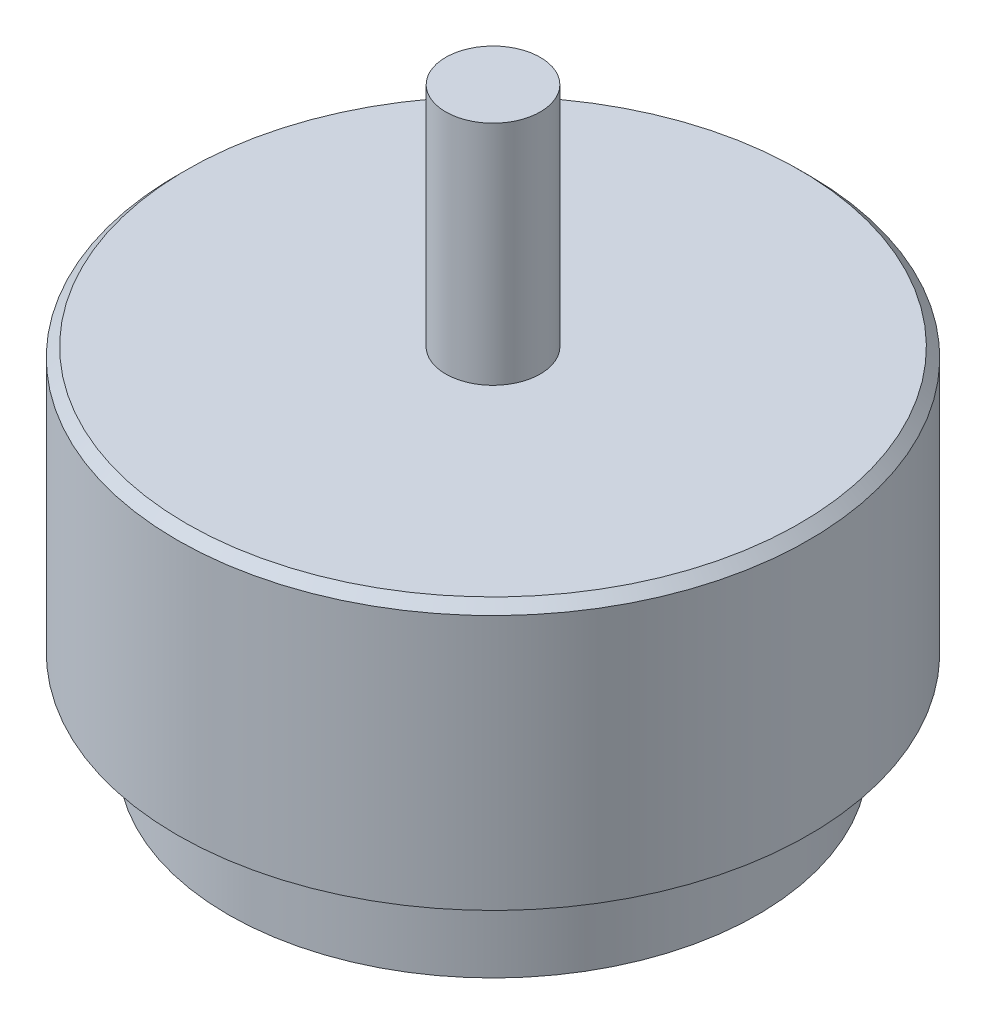
ISO-10303-21;
HEADER;
FILE_DESCRIPTION(('STEP AP214'),'2;1');
FILE_NAME('part.step','',(''),(''),'','','');
FILE_SCHEMA(('AUTOMOTIVE_DESIGN { 1 0 10303 214 1 1 1 1 }'));
ENDSEC;
DATA;
#1=APPLICATION_CONTEXT('core data for automotive mechanical design processes');
#2=APPLICATION_PROTOCOL_DEFINITION('international standard','automotive_design',2000,#1);
#3=PRODUCT_CONTEXT('',#1,'mechanical');
#4=PRODUCT('Part','Part','',(#3));
#5=PRODUCT_RELATED_PRODUCT_CATEGORY('part','',(#4));
#6=PRODUCT_DEFINITION_FORMATION('','',#4);
#7=PRODUCT_DEFINITION_CONTEXT('part definition',#1,'design');
#8=PRODUCT_DEFINITION('design','',#6,#7);
#9=PRODUCT_DEFINITION_SHAPE('','',#8);
#10=(LENGTH_UNIT() NAMED_UNIT(*) SI_UNIT(.MILLI.,.METRE.));
#11=(NAMED_UNIT(*) PLANE_ANGLE_UNIT() SI_UNIT($,.RADIAN.));
#12=(NAMED_UNIT(*) SI_UNIT($,.STERADIAN.) SOLID_ANGLE_UNIT());
#13=UNCERTAINTY_MEASURE_WITH_UNIT(LENGTH_MEASURE(1.E-05),#10,'distance_accuracy_value','');
#14=(GEOMETRIC_REPRESENTATION_CONTEXT(3) GLOBAL_UNCERTAINTY_ASSIGNED_CONTEXT((#13)) GLOBAL_UNIT_ASSIGNED_CONTEXT((#10,
#11,#12)) REPRESENTATION_CONTEXT('',''));
#15=CARTESIAN_POINT('',(0.,0.,0.));
#16=DIRECTION('',(0.,0.,1.));
#17=DIRECTION('',(1.,0.,0.));
#18=AXIS2_PLACEMENT_3D('',#15,#16,#17);
#19=CARTESIAN_POINT('',(0.,5.,0.));
#20=DIRECTION('',(0.,-1.,0.));
#21=DIRECTION('',(0.,0.,-1.));
#22=AXIS2_PLACEMENT_3D('',#19,#20,#21);
#23=CYLINDRICAL_SURFACE('',#22,14.);
#24=CARTESIAN_POINT('',(0.,5.,0.));
#25=DIRECTION('',(0.,1.,0.));
#26=DIRECTION('',(0.,0.,1.));
#27=AXIS2_PLACEMENT_3D('',#24,#25,#26);
#28=CIRCLE('',#27,14.);
#29=CARTESIAN_POINT('',(0.,5.,14.));
#30=VERTEX_POINT('',#29);
#31=EDGE_CURVE('E55',#30,#30,#28,.T.);
#32=ORIENTED_EDGE('',*,*,#31,.F.);
#33=EDGE_LOOP('',(#32));
#34=FACE_BOUND('',#33,.T.);
#35=CARTESIAN_POINT('',(0.,0.,0.));
#36=DIRECTION('',(0.,1.,0.));
#37=DIRECTION('',(0.,0.,1.));
#38=AXIS2_PLACEMENT_3D('',#35,#36,#37);
#39=CIRCLE('',#38,14.);
#40=CARTESIAN_POINT('',(0.,0.,14.));
#41=VERTEX_POINT('',#40);
#42=EDGE_CURVE('E58',#41,#41,#39,.T.);
#43=ORIENTED_EDGE('',*,*,#42,.T.);
#44=EDGE_LOOP('',(#43));
#45=FACE_BOUND('',#44,.T.);
#46=ADVANCED_FACE('F39',(#34,#45),#23,.T.);
#47=CARTESIAN_POINT('',(0.,0.,0.));
#48=DIRECTION('',(0.,1.,0.));
#49=DIRECTION('',(0.,0.,1.));
#50=AXIS2_PLACEMENT_3D('',#47,#48,#49);
#51=PLANE('',#50);
#52=CARTESIAN_POINT('',(0.,0.,0.));
#53=DIRECTION('',(0.,-1.,0.));
#54=DIRECTION('',(0.,0.,-1.));
#55=AXIS2_PLACEMENT_3D('',#52,#53,#54);
#56=CIRCLE('',#55,7.);
#57=CARTESIAN_POINT('',(0.,0.,-7.));
#58=VERTEX_POINT('',#57);
#59=EDGE_CURVE('E70',#58,#58,#56,.T.);
#60=ORIENTED_EDGE('',*,*,#59,.F.);
#61=EDGE_LOOP('',(#60));
#62=FACE_BOUND('',#61,.T.);
#63=ORIENTED_EDGE('',*,*,#42,.F.);
#64=EDGE_LOOP('',(#63));
#65=FACE_BOUND('',#64,.T.);
#66=ADVANCED_FACE('F84',(#62,#65),#51,.F.);
#67=CARTESIAN_POINT('',(0.,19.,0.));
#68=DIRECTION('',(0.,-1.,0.));
#69=DIRECTION('',(0.,0.,-1.));
#70=AXIS2_PLACEMENT_3D('',#67,#68,#69);
#71=CYLINDRICAL_SURFACE('',#70,16.7);
#72=CARTESIAN_POINT('',(0.,18.5,0.));
#73=DIRECTION('',(0.,1.,0.));
#74=DIRECTION('',(0.,0.,1.));
#75=AXIS2_PLACEMENT_3D('',#72,#73,#74);
#76=CIRCLE('',#75,16.7);
#77=CARTESIAN_POINT('',(0.,18.5,16.7));
#78=VERTEX_POINT('',#77);
#79=EDGE_CURVE('E10',#78,#78,#76,.F.);
#80=ORIENTED_EDGE('',*,*,#79,.T.);
#81=EDGE_LOOP('',(#80));
#82=FACE_BOUND('',#81,.T.);
#83=CARTESIAN_POINT('',(0.,5.,0.));
#84=DIRECTION('',(0.,1.,0.));
#85=DIRECTION('',(0.,0.,1.));
#86=AXIS2_PLACEMENT_3D('',#83,#84,#85);
#87=CIRCLE('',#86,16.7);
#88=CARTESIAN_POINT('',(0.,5.,16.7));
#89=VERTEX_POINT('',#88);
#90=EDGE_CURVE('E61',#89,#89,#87,.T.);
#91=ORIENTED_EDGE('',*,*,#90,.T.);
#92=EDGE_LOOP('',(#91));
#93=FACE_BOUND('',#92,.T.);
#94=ADVANCED_FACE('F87',(#82,#93),#71,.T.);
#95=CARTESIAN_POINT('',(0.,19.,0.));
#96=DIRECTION('',(0.,1.,0.));
#97=DIRECTION('',(0.,0.,1.));
#98=AXIS2_PLACEMENT_3D('',#95,#96,#97);
#99=PLANE('',#98);
#100=CARTESIAN_POINT('',(0.,19.,0.));
#101=DIRECTION('',(0.,1.,0.));
#102=DIRECTION('',(0.,0.,1.));
#103=AXIS2_PLACEMENT_3D('',#100,#101,#102);
#104=CIRCLE('',#103,16.2);
#105=CARTESIAN_POINT('',(0.,19.,16.2));
#106=VERTEX_POINT('',#105);
#107=EDGE_CURVE('E47',#106,#106,#104,.T.);
#108=ORIENTED_EDGE('',*,*,#107,.T.);
#109=EDGE_LOOP('',(#108));
#110=FACE_BOUND('',#109,.T.);
#111=CARTESIAN_POINT('',(0.,19.,0.));
#112=DIRECTION('',(0.,1.,0.));
#113=DIRECTION('',(0.,0.,1.));
#114=AXIS2_PLACEMENT_3D('',#111,#112,#113);
#115=CIRCLE('',#114,2.5);
#116=CARTESIAN_POINT('',(0.,19.,2.5));
#117=VERTEX_POINT('',#116);
#118=EDGE_CURVE('E51',#117,#117,#115,.T.);
#119=ORIENTED_EDGE('',*,*,#118,.F.);
#120=EDGE_LOOP('',(#119));
#121=FACE_BOUND('',#120,.T.);
#122=ADVANCED_FACE('F99',(#110,#121),#99,.T.);
#123=CARTESIAN_POINT('',(0.,5.,0.));
#124=DIRECTION('',(0.,1.,0.));
#125=DIRECTION('',(0.,0.,1.));
#126=AXIS2_PLACEMENT_3D('',#123,#124,#125);
#127=PLANE('',#126);
#128=ORIENTED_EDGE('',*,*,#31,.T.);
#129=EDGE_LOOP('',(#128));
#130=FACE_BOUND('',#129,.T.);
#131=ORIENTED_EDGE('',*,*,#90,.F.);
#132=EDGE_LOOP('',(#131));
#133=FACE_BOUND('',#132,.T.);
#134=ADVANCED_FACE('F100',(#130,#133),#127,.F.);
#135=CARTESIAN_POINT('',(0.,31.,0.));
#136=DIRECTION('',(0.,-1.,0.));
#137=DIRECTION('',(0.,0.,-1.));
#138=AXIS2_PLACEMENT_3D('',#135,#136,#137);
#139=CYLINDRICAL_SURFACE('',#138,2.5);
#140=CARTESIAN_POINT('',(0.,31.,0.));
#141=DIRECTION('',(0.,1.,0.));
#142=DIRECTION('',(0.,0.,1.));
#143=AXIS2_PLACEMENT_3D('',#140,#141,#142);
#144=CIRCLE('',#143,2.5);
#145=CARTESIAN_POINT('',(0.,31.,2.5));
#146=VERTEX_POINT('',#145);
#147=EDGE_CURVE('E65',#146,#146,#144,.T.);
#148=ORIENTED_EDGE('',*,*,#147,.F.);
#149=EDGE_LOOP('',(#148));
#150=FACE_BOUND('',#149,.T.);
#151=ORIENTED_EDGE('',*,*,#118,.T.);
#152=EDGE_LOOP('',(#151));
#153=FACE_BOUND('',#152,.T.);
#154=ADVANCED_FACE('F103',(#150,#153),#139,.T.);
#155=CARTESIAN_POINT('',(0.,31.,0.));
#156=DIRECTION('',(0.,1.,0.));
#157=DIRECTION('',(0.,0.,1.));
#158=AXIS2_PLACEMENT_3D('',#155,#156,#157);
#159=PLANE('',#158);
#160=ORIENTED_EDGE('',*,*,#147,.T.);
#161=EDGE_LOOP('',(#160));
#162=FACE_BOUND('',#161,.T.);
#163=ADVANCED_FACE('F109',(#162),#159,.T.);
#164=CARTESIAN_POINT('',(0.,19.,0.));
#165=DIRECTION('',(0.,-1.,0.));
#166=DIRECTION('',(0.,0.,-1.));
#167=AXIS2_PLACEMENT_3D('',#164,#165,#166);
#168=CONICAL_SURFACE('',#167,16.2,0.785398163397445);
#169=ORIENTED_EDGE('',*,*,#79,.F.);
#170=EDGE_LOOP('',(#169));
#171=FACE_BOUND('',#170,.T.);
#172=ORIENTED_EDGE('',*,*,#107,.F.);
#173=EDGE_LOOP('',(#172));
#174=FACE_BOUND('',#173,.T.);
#175=ADVANCED_FACE('F42',(#171,#174),#168,.T.);
#176=CARTESIAN_POINT('',(0.,6.,0.));
#177=DIRECTION('',(0.,-1.,0.));
#178=DIRECTION('',(0.,0.,-1.));
#179=AXIS2_PLACEMENT_3D('',#176,#177,#178);
#180=CYLINDRICAL_SURFACE('',#179,7.);
#181=CARTESIAN_POINT('',(0.,6.,0.));
#182=DIRECTION('',(0.,-1.,0.));
#183=DIRECTION('',(0.,0.,-1.));
#184=AXIS2_PLACEMENT_3D('',#181,#182,#183);
#185=CIRCLE('',#184,7.);
#186=CARTESIAN_POINT('',(0.,6.,-7.));
#187=VERTEX_POINT('',#186);
#188=EDGE_CURVE('E69',#187,#187,#185,.T.);
#189=ORIENTED_EDGE('',*,*,#188,.F.);
#190=EDGE_LOOP('',(#189));
#191=FACE_BOUND('',#190,.T.);
#192=ORIENTED_EDGE('',*,*,#59,.T.);
#193=EDGE_LOOP('',(#192));
#194=FACE_BOUND('',#193,.T.);
#195=ADVANCED_FACE('F78',(#191,#194),#180,.F.);
#196=CARTESIAN_POINT('',(0.,6.,0.));
#197=DIRECTION('',(0.,-1.,0.));
#198=DIRECTION('',(0.,0.,-1.));
#199=AXIS2_PLACEMENT_3D('',#196,#197,#198);
#200=PLANE('',#199);
#201=ORIENTED_EDGE('',*,*,#188,.T.);
#202=EDGE_LOOP('',(#201));
#203=FACE_BOUND('',#202,.T.);
#204=ADVANCED_FACE('F76',(#203),#200,.T.);
#205=CLOSED_SHELL('',(#46,#66,#94,#122,#134,#154,#163,#175,#195,#204));
#206=MANIFOLD_SOLID_BREP('B2',#205);
#207=ADVANCED_BREP_SHAPE_REPRESENTATION('',(#18,#206),#14);
#208=SHAPE_DEFINITION_REPRESENTATION(#9,#207);
ENDSEC;
END-ISO-10303-21;
